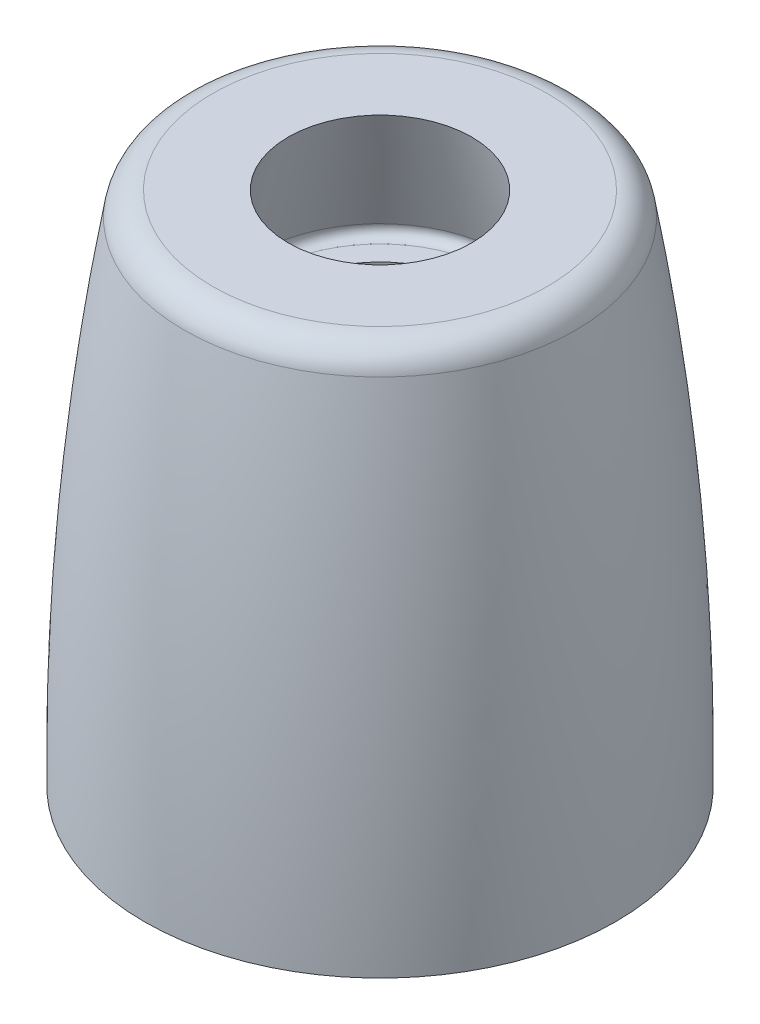
ISO-10303-21;
HEADER;
FILE_DESCRIPTION(('STEP AP214'),'2;1');
FILE_NAME('part.step','',(''),(''),'','','');
FILE_SCHEMA(('AUTOMOTIVE_DESIGN { 1 0 10303 214 1 1 1 1 }'));
ENDSEC;
DATA;
#1=APPLICATION_CONTEXT('core data for automotive mechanical design processes');
#2=APPLICATION_PROTOCOL_DEFINITION('international standard','automotive_design',2000,#1);
#3=PRODUCT_CONTEXT('',#1,'mechanical');
#4=PRODUCT('Part','Part','',(#3));
#5=PRODUCT_RELATED_PRODUCT_CATEGORY('part','',(#4));
#6=PRODUCT_DEFINITION_FORMATION('','',#4);
#7=PRODUCT_DEFINITION_CONTEXT('part definition',#1,'design');
#8=PRODUCT_DEFINITION('design','',#6,#7);
#9=PRODUCT_DEFINITION_SHAPE('','',#8);
#10=(LENGTH_UNIT() NAMED_UNIT(*) SI_UNIT(.MILLI.,.METRE.));
#11=(NAMED_UNIT(*) PLANE_ANGLE_UNIT() SI_UNIT($,.RADIAN.));
#12=(NAMED_UNIT(*) SI_UNIT($,.STERADIAN.) SOLID_ANGLE_UNIT());
#13=UNCERTAINTY_MEASURE_WITH_UNIT(LENGTH_MEASURE(1.E-05),#10,'distance_accuracy_value','');
#14=(GEOMETRIC_REPRESENTATION_CONTEXT(3) GLOBAL_UNCERTAINTY_ASSIGNED_CONTEXT((#13)) GLOBAL_UNIT_ASSIGNED_CONTEXT((#10,
#11,#12)) REPRESENTATION_CONTEXT('',''));
#15=CARTESIAN_POINT('',(0.,0.,0.));
#16=DIRECTION('',(0.,0.,1.));
#17=DIRECTION('',(1.,0.,0.));
#18=AXIS2_PLACEMENT_3D('',#15,#16,#17);
#19=CARTESIAN_POINT('',(5.18,24.3102710708781,0.));
#20=DIRECTION('',(0.,1.,0.));
#21=DIRECTION('',(0.,0.,1.));
#22=AXIS2_PLACEMENT_3D('',#19,#20,#21);
#23=PLANE('',#22);
#24=CARTESIAN_POINT('',(0.,24.3102710708781,0.));
#25=DIRECTION('',(0.,-1.,0.));
#26=DIRECTION('',(0.,0.,-1.));
#27=AXIS2_PLACEMENT_3D('',#24,#25,#26);
#28=CIRCLE('',#27,5.18);
#29=CARTESIAN_POINT('',(0.,24.3102710708781,-5.18));
#30=VERTEX_POINT('',#29);
#31=EDGE_CURVE('E59',#30,#30,#28,.T.);
#32=ORIENTED_EDGE('',*,*,#31,.T.);
#33=EDGE_LOOP('',(#32));
#34=FACE_BOUND('',#33,.T.);
#35=CARTESIAN_POINT('',(0.,24.3102710708781,0.));
#36=DIRECTION('',(0.,-1.,0.));
#37=DIRECTION('',(0.,0.,-1.));
#38=AXIS2_PLACEMENT_3D('',#35,#36,#37);
#39=CIRCLE('',#38,6.40293581798289);
#40=CARTESIAN_POINT('',(0.,24.3102710708781,6.40293581798289));
#41=VERTEX_POINT('',#40);
#42=CARTESIAN_POINT('',(0.,24.3102710708781,-6.40293581798289));
#43=VERTEX_POINT('',#42);
#44=EDGE_CURVE('E52',#41,#43,#39,.F.);
#45=ORIENTED_EDGE('',*,*,#44,.T.);
#46=CARTESIAN_POINT('',(0.,24.3102710708781,0.));
#47=DIRECTION('',(0.,-1.,0.));
#48=DIRECTION('',(0.,0.,1.));
#49=AXIS2_PLACEMENT_3D('',#46,#47,#48);
#50=CIRCLE('',#49,6.40293581798289);
#51=EDGE_CURVE('E57',#43,#41,#50,.F.);
#52=ORIENTED_EDGE('',*,*,#51,.T.);
#53=EDGE_LOOP('',(#45,#52));
#54=FACE_BOUND('',#53,.T.);
#55=ADVANCED_FACE('F17',(#34,#54),#23,.T.);
#56=CARTESIAN_POINT('',(0.,31.0037578537676,0.));
#57=DIRECTION('',(0.,-1.,0.));
#58=DIRECTION('',(0.,0.,-1.));
#59=AXIS2_PLACEMENT_3D('',#56,#57,#58);
#60=CYLINDRICAL_SURFACE('',#59,5.18);
#61=CARTESIAN_POINT('',(0.,15.7602711168781,0.));
#62=DIRECTION('',(0.,-1.,0.));
#63=DIRECTION('',(0.,0.,-1.));
#64=AXIS2_PLACEMENT_3D('',#61,#62,#63);
#65=CIRCLE('',#64,5.18);
#66=CARTESIAN_POINT('',(0.,15.7602711168781,-5.18));
#67=VERTEX_POINT('',#66);
#68=EDGE_CURVE('E62',#67,#67,#65,.F.);
#69=ORIENTED_EDGE('',*,*,#68,.F.);
#70=EDGE_LOOP('',(#69));
#71=FACE_BOUND('',#70,.T.);
#72=ORIENTED_EDGE('',*,*,#31,.F.);
#73=EDGE_LOOP('',(#72));
#74=FACE_BOUND('',#73,.T.);
#75=ADVANCED_FACE('F88',(#71,#74),#60,.F.);
#76=CARTESIAN_POINT('',(0.,24.8102710708781,0.));
#77=DIRECTION('',(0.,1.,0.));
#78=DIRECTION('',(0.,0.,1.));
#79=AXIS2_PLACEMENT_3D('',#76,#77,#78);
#80=TOROIDAL_SURFACE('',#79,6.40293581798289,0.5);
#81=CARTESIAN_POINT('',(0.,24.9444058474637,0.));
#82=DIRECTION('',(0.,-1.,0.));
#83=DIRECTION('',(0.,0.,-1.));
#84=AXIS2_PLACEMENT_3D('',#81,#82,#83);
#85=CIRCLE('',#84,6.88460776206057);
#86=CARTESIAN_POINT('',(0.,24.9444058474637,-6.88460776206057));
#87=VERTEX_POINT('',#86);
#88=EDGE_CURVE('E95',#87,#87,#85,.F.);
#89=ORIENTED_EDGE('',*,*,#88,.T.);
#90=EDGE_LOOP('',(#89));
#91=FACE_BOUND('',#90,.T.);
#92=ORIENTED_EDGE('',*,*,#51,.F.);
#93=ORIENTED_EDGE('',*,*,#44,.F.);
#94=EDGE_LOOP('',(#92,#93));
#95=FACE_BOUND('',#94,.T.);
#96=ADVANCED_FACE('F56',(#91,#95),#80,.F.);
#97=CARTESIAN_POINT('',(9.7536,15.7602711168781,0.));
#98=DIRECTION('',(0.,-1.,0.));
#99=DIRECTION('',(0.,0.,-1.));
#100=AXIS2_PLACEMENT_3D('',#97,#98,#99);
#101=PLANE('',#100);
#102=ORIENTED_EDGE('',*,*,#68,.T.);
#103=EDGE_LOOP('',(#102));
#104=FACE_BOUND('',#103,.T.);
#105=CARTESIAN_POINT('',(0.,15.7602711168781,0.));
#106=DIRECTION('',(0.,1.,0.));
#107=DIRECTION('',(0.,0.,1.));
#108=AXIS2_PLACEMENT_3D('',#105,#106,#107);
#109=CIRCLE('',#108,7.7536);
#110=CARTESIAN_POINT('',(0.,15.7602711168781,-7.7536));
#111=VERTEX_POINT('',#110);
#112=CARTESIAN_POINT('',(0.,15.7602711168781,7.7536));
#113=VERTEX_POINT('',#112);
#114=EDGE_CURVE('E98',#111,#113,#109,.F.);
#115=ORIENTED_EDGE('',*,*,#114,.T.);
#116=CARTESIAN_POINT('',(0.,15.7602711168781,0.));
#117=DIRECTION('',(0.,1.,0.));
#118=DIRECTION('',(0.,0.,-1.));
#119=AXIS2_PLACEMENT_3D('',#116,#117,#118);
#120=CIRCLE('',#119,7.7536);
#121=EDGE_CURVE('E143',#113,#111,#120,.F.);
#122=ORIENTED_EDGE('',*,*,#121,.T.);
#123=EDGE_LOOP('',(#115,#122));
#124=FACE_BOUND('',#123,.T.);
#125=ADVANCED_FACE('F87',(#104,#124),#101,.T.);
#126=CARTESIAN_POINT('',(0.,24.9444058475206,0.));
#127=DIRECTION('',(0.,-1.,0.));
#128=DIRECTION('',(1.,0.,0.));
#129=AXIS2_PLACEMENT_3D('',#126,#127,#128);
#130=CONICAL_SURFACE('',#129,6.88460776200372,0.271596289014058);
#131=ORIENTED_EDGE('',*,*,#88,.F.);
#132=EDGE_LOOP('',(#131));
#133=FACE_BOUND('',#132,.T.);
#134=CARTESIAN_POINT('',(0.,31.4246710808561,0.));
#135=DIRECTION('',(0.,-1.,0.));
#136=DIRECTION('',(1.,0.,0.));
#137=AXIS2_PLACEMENT_3D('',#134,#135,#136);
#138=CIRCLE('',#137,5.07999999999242);
#139=CARTESIAN_POINT('',(5.07999999999243,31.4246710808561,0.));
#140=VERTEX_POINT('',#139);
#141=EDGE_CURVE('E131',#140,#140,#138,.T.);
#142=ORIENTED_EDGE('',*,*,#141,.F.);
#143=EDGE_LOOP('',(#142));
#144=FACE_BOUND('',#143,.T.);
#145=ADVANCED_FACE('F116',(#133,#144),#130,.F.);
#146=CARTESIAN_POINT('',(0.,13.7602711168781,0.));
#147=DIRECTION('',(0.,-1.,0.));
#148=DIRECTION('',(0.,0.,-1.));
#149=AXIS2_PLACEMENT_3D('',#146,#147,#148);
#150=TOROIDAL_SURFACE('',#149,7.7536,2.);
#151=CARTESIAN_POINT('',(0.,13.7602711168781,0.));
#152=DIRECTION('',(0.,-1.,0.));
#153=DIRECTION('',(0.,0.,-1.));
#154=AXIS2_PLACEMENT_3D('',#151,#152,#153);
#155=CIRCLE('',#154,9.7536);
#156=CARTESIAN_POINT('',(0.,13.7602711168781,-9.7536));
#157=VERTEX_POINT('',#156);
#158=EDGE_CURVE('E128',#157,#157,#155,.T.);
#159=ORIENTED_EDGE('',*,*,#158,.T.);
#160=EDGE_LOOP('',(#159));
#161=FACE_BOUND('',#160,.T.);
#162=ORIENTED_EDGE('',*,*,#121,.F.);
#163=ORIENTED_EDGE('',*,*,#114,.F.);
#164=EDGE_LOOP('',(#162,#163));
#165=FACE_BOUND('',#164,.T.);
#166=ADVANCED_FACE('F105',(#161,#165),#150,.F.);
#167=CARTESIAN_POINT('',(5.08,31.4246710808781,0.));
#168=DIRECTION('',(0.,1.,0.));
#169=DIRECTION('',(0.,0.,1.));
#170=AXIS2_PLACEMENT_3D('',#167,#168,#169);
#171=PLANE('',#170);
#172=ORIENTED_EDGE('',*,*,#141,.T.);
#173=EDGE_LOOP('',(#172));
#174=FACE_BOUND('',#173,.T.);
#175=CARTESIAN_POINT('',(0.,31.4246710808781,0.));
#176=DIRECTION('',(0.,-1.,0.));
#177=DIRECTION('',(0.,0.,-1.));
#178=AXIS2_PLACEMENT_3D('',#175,#176,#177);
#179=CIRCLE('',#178,9.26112285375294);
#180=CARTESIAN_POINT('',(0.,31.4246710808781,-9.26112285375294));
#181=VERTEX_POINT('',#180);
#182=CARTESIAN_POINT('',(0.,31.4246710808781,9.26112285375294));
#183=VERTEX_POINT('',#182);
#184=EDGE_CURVE('E186',#181,#183,#179,.T.);
#185=ORIENTED_EDGE('',*,*,#184,.F.);
#186=CARTESIAN_POINT('',(0.,31.4246710808781,0.));
#187=DIRECTION('',(0.,-1.,0.));
#188=DIRECTION('',(0.,0.,1.));
#189=AXIS2_PLACEMENT_3D('',#186,#187,#188);
#190=CIRCLE('',#189,9.26112285375294);
#191=EDGE_CURVE('E37',#183,#181,#190,.T.);
#192=ORIENTED_EDGE('',*,*,#191,.F.);
#193=EDGE_LOOP('',(#185,#192));
#194=FACE_BOUND('',#193,.T.);
#195=ADVANCED_FACE('F115',(#174,#194),#171,.T.);
#196=CARTESIAN_POINT('',(0.,31.0037578537676,0.));
#197=DIRECTION('',(0.,-1.,0.));
#198=DIRECTION('',(0.,0.,-1.));
#199=AXIS2_PLACEMENT_3D('',#196,#197,#198);
#200=CYLINDRICAL_SURFACE('',#199,9.7536);
#201=CARTESIAN_POINT('',(0.,2.86027108087809,0.));
#202=DIRECTION('',(0.,-1.,0.));
#203=DIRECTION('',(0.,0.,-1.));
#204=AXIS2_PLACEMENT_3D('',#201,#202,#203);
#205=CIRCLE('',#204,9.7536);
#206=CARTESIAN_POINT('',(0.,2.86027108087809,-9.7536));
#207=VERTEX_POINT('',#206);
#208=EDGE_CURVE('E157',#207,#207,#205,.F.);
#209=ORIENTED_EDGE('',*,*,#208,.F.);
#210=EDGE_LOOP('',(#209));
#211=FACE_BOUND('',#210,.T.);
#212=ORIENTED_EDGE('',*,*,#158,.F.);
#213=EDGE_LOOP('',(#212));
#214=FACE_BOUND('',#213,.T.);
#215=ADVANCED_FACE('F178',(#211,#214),#200,.F.);
#216=CARTESIAN_POINT('',(0.,29.8371710808781,0.));
#217=DIRECTION('',(0.,1.,0.));
#218=DIRECTION('',(0.,0.,1.));
#219=AXIS2_PLACEMENT_3D('',#216,#217,#218);
#220=TOROIDAL_SURFACE('',#219,9.26112285375294,1.5875);
#221=ORIENTED_EDGE('',*,*,#191,.T.);
#222=ORIENTED_EDGE('',*,*,#184,.T.);
#223=EDGE_LOOP('',(#221,#222));
#224=FACE_BOUND('',#223,.T.);
#225=CARTESIAN_POINT('',(0.,30.1075682269506,0.));
#226=DIRECTION('',(0.,-1.,0.));
#227=DIRECTION('',(0.,0.,-1.));
#228=AXIS2_PLACEMENT_3D('',#225,#226,#227);
#229=CIRCLE('',#228,10.8254251370076);
#230=CARTESIAN_POINT('',(0.,30.1075682269506,-10.8254251370076));
#231=VERTEX_POINT('',#230);
#232=EDGE_CURVE('E29',#231,#231,#229,.T.);
#233=ORIENTED_EDGE('',*,*,#232,.F.);
#234=EDGE_LOOP('',(#233));
#235=FACE_BOUND('',#234,.T.);
#236=ADVANCED_FACE('F167',(#224,#235),#220,.T.);
#237=CARTESIAN_POINT('',(9.7536,2.86027108087809,0.));
#238=DIRECTION('',(0.,-1.,0.));
#239=DIRECTION('',(0.,0.,-1.));
#240=AXIS2_PLACEMENT_3D('',#237,#238,#239);
#241=PLANE('',#240);
#242=ORIENTED_EDGE('',*,*,#208,.T.);
#243=EDGE_LOOP('',(#242));
#244=FACE_BOUND('',#243,.T.);
#245=CARTESIAN_POINT('',(0.,2.86027108087808,0.));
#246=DIRECTION('',(0.,-1.,0.));
#247=DIRECTION('',(0.,0.,-1.));
#248=AXIS2_PLACEMENT_3D('',#245,#246,#247);
#249=CIRCLE('',#248,13.0469532151716);
#250=CARTESIAN_POINT('',(0.,2.86027108087808,-13.0469532151716));
#251=VERTEX_POINT('',#250);
#252=EDGE_CURVE('E11',#251,#251,#249,.F.);
#253=ORIENTED_EDGE('',*,*,#252,.F.);
#254=EDGE_LOOP('',(#253));
#255=FACE_BOUND('',#254,.T.);
#256=ADVANCED_FACE('F177',(#244,#255),#241,.T.);
#257=CARTESIAN_POINT('',(0.,4.14944220398613,139.347594055442));
#258=DIRECTION('',(1.,0.,0.));
#259=DIRECTION('',(0.,0.,-1.));
#260=AXIS2_PLACEMENT_3D('',#257,#258,#259);
#261=CIRCLE('',#260,152.4);
#262=TRIMMED_CURVE('',#261,(PARAMETER_VALUE(-0.416885964195666)),
(PARAMETER_VALUE(0.416885964195666)),.T.,.PARAMETER.);
#263=CARTESIAN_POINT('',(0.,4.14944220398613,0.));
#264=DIRECTION('',(0.,-1.,0.));
#265=AXIS1_PLACEMENT('',#263,#264);
#266=SURFACE_OF_REVOLUTION('',#262,#265);
#267=ORIENTED_EDGE('',*,*,#252,.T.);
#268=EDGE_LOOP('',(#267));
#269=FACE_BOUND('',#268,.T.);
#270=ORIENTED_EDGE('',*,*,#232,.T.);
#271=EDGE_LOOP('',(#270));
#272=FACE_BOUND('',#271,.T.);
#273=ADVANCED_FACE('F209',(#269,#272),#266,.F.);
#274=CLOSED_SHELL('',(#55,#75,#96,#125,#145,#166,#195,#215,#236,#256,#273));
#275=MANIFOLD_SOLID_BREP('B1',#274);
#276=ADVANCED_BREP_SHAPE_REPRESENTATION('',(#18,#275),#14);
#277=SHAPE_DEFINITION_REPRESENTATION(#9,#276);
ENDSEC;
END-ISO-10303-21;
